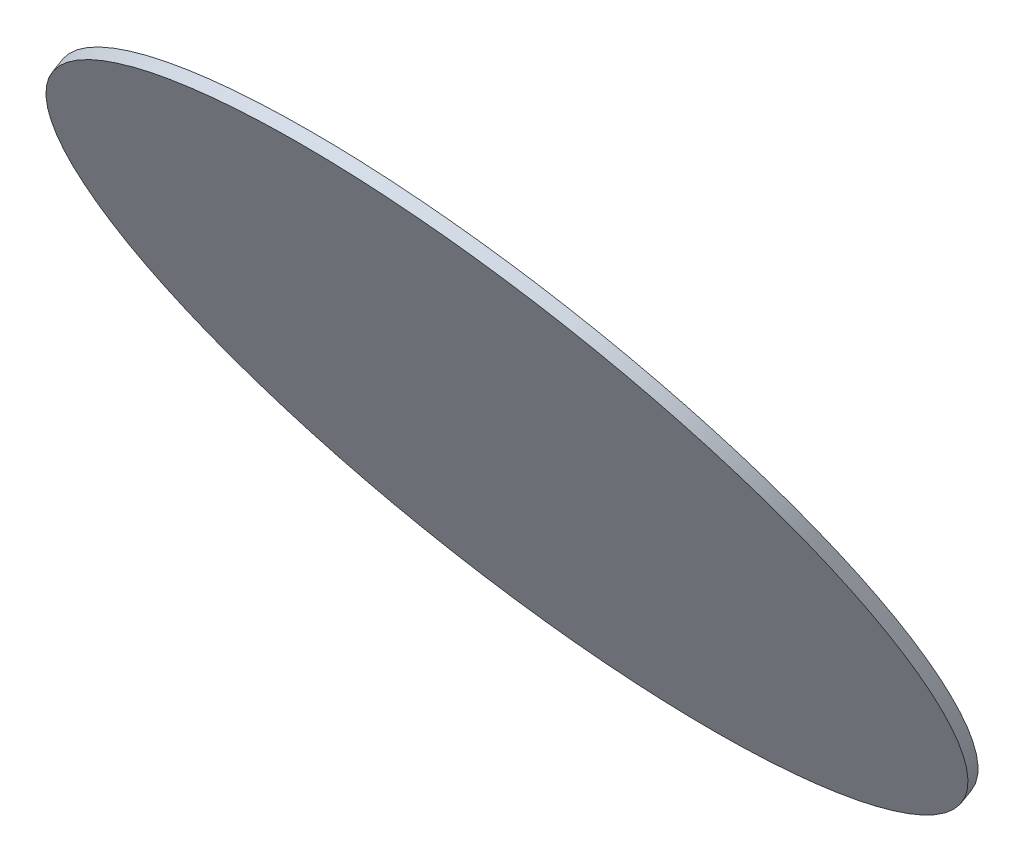
ISO-10303-21;
HEADER;
FILE_DESCRIPTION(('STEP AP214'),'2;1');
FILE_NAME('part.step','',(''),(''),'','','');
FILE_SCHEMA(('AUTOMOTIVE_DESIGN { 1 0 10303 214 1 1 1 1 }'));
ENDSEC;
DATA;
#1=APPLICATION_CONTEXT('core data for automotive mechanical design processes');
#2=APPLICATION_PROTOCOL_DEFINITION('international standard','automotive_design',2000,#1);
#3=PRODUCT_CONTEXT('',#1,'mechanical');
#4=PRODUCT('Part','Part','',(#3));
#5=PRODUCT_RELATED_PRODUCT_CATEGORY('part','',(#4));
#6=PRODUCT_DEFINITION_FORMATION('','',#4);
#7=PRODUCT_DEFINITION_CONTEXT('part definition',#1,'design');
#8=PRODUCT_DEFINITION('design','',#6,#7);
#9=PRODUCT_DEFINITION_SHAPE('','',#8);
#10=(LENGTH_UNIT() NAMED_UNIT(*) SI_UNIT(.MILLI.,.METRE.));
#11=(NAMED_UNIT(*) PLANE_ANGLE_UNIT() SI_UNIT($,.RADIAN.));
#12=(NAMED_UNIT(*) SI_UNIT($,.STERADIAN.) SOLID_ANGLE_UNIT());
#13=UNCERTAINTY_MEASURE_WITH_UNIT(LENGTH_MEASURE(1.E-05),#10,'distance_accuracy_value','');
#14=(GEOMETRIC_REPRESENTATION_CONTEXT(3) GLOBAL_UNCERTAINTY_ASSIGNED_CONTEXT((#13)) GLOBAL_UNIT_ASSIGNED_CONTEXT((#10,
#11,#12)) REPRESENTATION_CONTEXT('',''));
#15=CARTESIAN_POINT('',(0.,0.,0.));
#16=DIRECTION('',(0.,0.,1.));
#17=DIRECTION('',(1.,0.,0.));
#18=AXIS2_PLACEMENT_3D('',#15,#16,#17);
#19=CARTESIAN_POINT('',(0.,13.6941541416685,-40.8560281123041));
#20=CARTESIAN_POINT('',(-0.925381735866404,13.6941541416685,-40.8560281123041));
#21=CARTESIAN_POINT('',(-2.77614520759922,13.5362913144206,-40.9471702581106));
#22=CARTESIAN_POINT('',(-5.44560471175057,12.8350084616864,-41.3520561019148));
#23=CARTESIAN_POINT('',(-7.90579268075965,11.6961869038362,-42.0095550348986));
#24=CARTESIAN_POINT('',(-10.0621654706667,10.1635909146798,-42.894399741797));
#25=CARTESIAN_POINT('',(-11.8318548844635,8.29611729859068,-43.9725861367505));
#26=CARTESIAN_POINT('',(-13.146852750431,6.16553201934396,-45.202680121255));
#27=CARTESIAN_POINT('',(-13.9566244380395,3.85371227437508,-46.5374098733307));
#28=CARTESIAN_POINT('',(-14.2300508754592,1.44949999999972,-47.9254824771303));
#29=CARTESIAN_POINT('',(-13.9566244380395,-0.954712274375638,-49.3135550809299));
#30=CARTESIAN_POINT('',(-13.1468527504311,-3.26653201934452,-50.6482848330055));
#31=CARTESIAN_POINT('',(-11.8318548844635,-5.39711729859124,-51.8783788175101));
#32=CARTESIAN_POINT('',(-10.0621654706668,-7.26459091468032,-52.9565652124636));
#33=CARTESIAN_POINT('',(-7.90579268075964,-8.79718690383673,-53.841409919362));
#34=CARTESIAN_POINT('',(-5.44560471175057,-9.93600846168693,-54.4989088523457));
#35=CARTESIAN_POINT('',(-2.77614520759922,-10.6372913144212,-54.90379469615));
#36=CARTESIAN_POINT('',(0.,-10.874085555293,-55.0405079148598));
#37=CARTESIAN_POINT('',(2.77614520759922,-10.6372913144212,-54.90379469615));
#38=CARTESIAN_POINT('',(5.44560471175057,-9.93600846168693,-54.4989088523457));
#39=CARTESIAN_POINT('',(7.90579268075964,-8.79718690383673,-53.841409919362));
#40=CARTESIAN_POINT('',(10.0621654706668,-7.26459091468033,-52.9565652124636));
#41=CARTESIAN_POINT('',(11.8318548844635,-5.39711729859124,-51.8783788175101));
#42=CARTESIAN_POINT('',(13.146852750431,-3.26653201934453,-50.6482848330056));
#43=CARTESIAN_POINT('',(13.9566244380395,-0.954712274375641,-49.3135550809299));
#44=CARTESIAN_POINT('',(14.2300508754592,1.44949999999971,-47.9254824771303));
#45=CARTESIAN_POINT('',(13.9566244380395,3.85371227437508,-46.5374098733307));
#46=CARTESIAN_POINT('',(13.146852750431,6.16553201934395,-45.202680121255));
#47=CARTESIAN_POINT('',(11.8318548844635,8.29611729859067,-43.9725861367505));
#48=CARTESIAN_POINT('',(10.0621654706668,10.1635909146798,-42.894399741797));
#49=CARTESIAN_POINT('',(7.90579268075965,11.6961869038362,-42.0095550348986));
#50=CARTESIAN_POINT('',(5.44560471175058,12.8350084616864,-41.3520561019148));
#51=CARTESIAN_POINT('',(2.77614520759922,13.5362913144207,-40.9471702581106));
#52=CARTESIAN_POINT('',(0.92538173586641,13.6941541416685,-40.8560281123041));
#53=CARTESIAN_POINT('',(0.,13.6941541416685,-40.8560281123041));
#54=B_SPLINE_CURVE_WITH_KNOTS('',3,(#19,#20,#21,#22,#23,#24,#25,#26,#27,#28,#29,#30,#31,#32,#33,
#34,#35,#36,#37,#38,#39,#40,#41,#42,#43,#44,#45,#46,#47,#48,#49,#50,#51,#52,#53),.UNSPECIFIED.,
.T.,.F.,(4,1,1,1,1,1,1,1,1,1,1,1,1,1,1,1,1,1,1,1,1,1,1,1,1,1,1,1,1,1,1,1,4),(0.,0.03125,0.0625,
0.09375,0.125,0.15625,0.1875,0.21875,0.25,0.28125,0.3125,0.34375,0.375,0.40625,0.4375,0.46875,
0.5,0.53125,0.5625,0.59375,0.625,0.65625,0.6875,0.71875,0.75,0.78125,0.8125,0.84375,0.875,
0.90625,0.9375,0.96875,1.),.UNSPECIFIED.);
#55=DIRECTION('',(0.,0.499999999999995,-0.866025403784442));
#56=VECTOR('',#55,1.);
#57=SURFACE_OF_LINEAR_EXTRUSION('',#54,#56);
#58=CARTESIAN_POINT('',(0.,13.6941541416685,-40.8560281123041));
#59=CARTESIAN_POINT('',(0.231346854511267,13.6941541001111,-40.8560281362972));
#60=CARTESIAN_POINT('',(0.462692025309559,13.6892208694022,-40.858876338375));
#61=CARTESIAN_POINT('',(0.924826718682874,13.6695354525247,-40.8702417191083));
#62=CARTESIAN_POINT('',(1.15561623692772,13.6547831900839,-40.8787589417997));
#63=CARTESIAN_POINT('',(1.61608373302783,13.6155071340622,-40.9014349833165));
#64=CARTESIAN_POINT('',(1.84576171088309,13.5909833404813,-40.915593802142));
#65=CARTESIAN_POINT('',(2.30345164583322,13.5322113193433,-40.9495258443668));
#66=CARTESIAN_POINT('',(2.5314636158556,13.4979631673254,-40.9692990241536));
#67=CARTESIAN_POINT('',(2.98526489819354,13.4197899242284,-41.0144323670991));
#68=CARTESIAN_POINT('',(3.21105421050909,13.3758648331492,-41.0397925302578));
#69=CARTESIAN_POINT('',(3.65987506699374,13.2784784326175,-41.0960185948203));
#70=CARTESIAN_POINT('',(3.88290658972718,13.2250170490912,-41.1268845389904));
#71=CARTESIAN_POINT('',(4.32567844468135,13.108698255475,-41.1940412257965));
#72=CARTESIAN_POINT('',(4.54541877690209,13.045840845385,-41.2303319684325));
#73=CARTESIAN_POINT('',(4.98107473813176,12.9108699366452,-41.3082574589262));
#74=CARTESIAN_POINT('',(5.19699039683706,12.8387565098989,-41.3498921652704));
#75=CARTESIAN_POINT('',(5.62446184828332,12.6854141784352,-41.4384244016191));
#76=CARTESIAN_POINT('',(5.83601764102427,12.6041852737177,-41.4853219316237));
#77=CARTESIAN_POINT('',(6.25427621111408,12.4328404163353,-41.5842479311577));
#78=CARTESIAN_POINT('',(6.46097895075249,12.3427243946416,-41.6362764405409));
#79=CARTESIAN_POINT('',(6.86903982866421,12.15383292353,-41.7453329822348));
#80=CARTESIAN_POINT('',(7.07039796693751,12.055057474112,-41.8023610145456));
#81=CARTESIAN_POINT('',(7.46727790315038,11.8490745356836,-41.9212853194957));
#82=CARTESIAN_POINT('',(7.66279974641348,11.7418671121777,-41.983181554316));
#83=CARTESIAN_POINT('',(8.04751388873849,11.5192485517259,-42.1117104401194));
#84=CARTESIAN_POINT('',(8.23670618780041,11.4038374147801,-42.1783430911026));
#85=CARTESIAN_POINT('',(8.60832902655066,11.1651187874385,-42.3161673548588));
#86=CARTESIAN_POINT('',(8.79075951370299,11.0418112357118,-42.3873590030413));
#87=CARTESIAN_POINT('',(9.14842786458957,10.7876060803775,-42.534124417903));
#88=CARTESIAN_POINT('',(9.32366572832382,10.65670847677,-42.6096981845821));
#89=CARTESIAN_POINT('',(9.6665177659532,10.3876293174683,-42.7650511096382));
#90=CARTESIAN_POINT('',(9.83413199905726,10.2494478183625,-42.8448302353439));
#91=CARTESIAN_POINT('',(10.1613044835728,9.96610813535278,-43.0084164776017));
#92=CARTESIAN_POINT('',(10.3208627349843,9.82094995144882,-43.0922235941537));
#93=CARTESIAN_POINT('',(10.6315685850966,9.52403137712251,-43.2636496129684));
#94=CARTESIAN_POINT('',(10.7827161184548,9.37227093542373,-43.3512685448356));
#95=CARTESIAN_POINT('',(11.076246948178,9.06252105742628,-43.5301027202788));
#96=CARTESIAN_POINT('',(11.2186302445431,8.90453162112761,-43.621317963855));
#97=CARTESIAN_POINT('',(11.4942787720556,8.58269680214334,-43.8071293832301));
#98=CARTESIAN_POINT('',(11.6275440740219,8.41885146495526,-43.9017255327611));
#99=CARTESIAN_POINT('',(11.8846018456287,8.08567924450688,-44.0940826039235));
#100=CARTESIAN_POINT('',(12.0083943152692,7.9163523612466,-44.1918435255549));
#101=CARTESIAN_POINT('',(12.2462429251696,7.57264425423304,-44.3902834936618));
#102=CARTESIAN_POINT('',(12.3602989897912,7.39826299122845,-44.4909625627991));
#103=CARTESIAN_POINT('',(12.5784120731789,7.04487190466953,-44.6949930017531));
#104=CARTESIAN_POINT('',(12.6824690919449,6.86586208111521,-44.7983443715698));
#105=CARTESIAN_POINT('',(12.8803210910136,6.50363953405489,-45.0074736566216));
#106=CARTESIAN_POINT('',(12.9741161510237,6.32042684320709,-45.1132515530016));
#107=CARTESIAN_POINT('',(13.1511806237187,5.95022570690677,-45.3269872786989));
#108=CARTESIAN_POINT('',(13.2344500364035,5.76323726145424,-45.4349451080162));
#109=CARTESIAN_POINT('',(13.3903010174004,5.38594813155225,-45.6527730887275));
#110=CARTESIAN_POINT('',(13.4628825026855,5.19564742138497,-45.7626432549695));
#111=CARTESIAN_POINT('',(13.5971958762622,4.81219574753704,-45.9840291820868));
#112=CARTESIAN_POINT('',(13.6589277645539,4.61904478385639,-46.0955449429621));
#113=CARTESIAN_POINT('',(13.7713798938113,4.2303545180668,-46.3199553725471));
#114=CARTESIAN_POINT('',(13.8221002203099,4.03481523452172,-46.432850030539));
#115=CARTESIAN_POINT('',(13.9123669057062,3.64181180442628,-46.659750666697));
#116=CARTESIAN_POINT('',(13.9519132646039,3.44434765787592,-46.7737566448632));
#117=CARTESIAN_POINT('',(14.0197773508999,3.04797651476144,-47.0026016310393));
#118=CARTESIAN_POINT('',(14.048094991073,2.84906950700134,-47.1174406455133));
#119=CARTESIAN_POINT('',(14.0934470672161,2.45029307864819,-47.3476743237695));
#120=CARTESIAN_POINT('',(14.110481503186,2.25042365805514,-47.4630689875517));
#121=CARTESIAN_POINT('',(14.1332122903687,1.85020282247057,-47.6941365947117));
#122=CARTESIAN_POINT('',(14.1389087296526,1.64985141123514,-47.809809535921));
#123=CARTESIAN_POINT('',(14.1389087296526,1.24914858876429,-48.0411554183396));
#124=CARTESIAN_POINT('',(14.1332122903687,1.04879717752886,-48.1568283595489));
#125=CARTESIAN_POINT('',(14.110481503186,0.648576341944287,-48.3878959667089));
#126=CARTESIAN_POINT('',(14.0934470672161,0.448706921351246,-48.5032906304911));
#127=CARTESIAN_POINT('',(14.048094991073,0.0499304929981018,-48.7335243087472));
#128=CARTESIAN_POINT('',(14.0197773508999,-0.148976514762002,-48.8483633232212));
#129=CARTESIAN_POINT('',(13.9519132646039,-0.54534765787648,-49.0772083093974));
#130=CARTESIAN_POINT('',(13.9123669057062,-0.742811804426838,-49.1912142875635));
#131=CARTESIAN_POINT('',(13.8221002203099,-1.13581523452228,-49.4181149237216));
#132=CARTESIAN_POINT('',(13.7713798938113,-1.33135451806736,-49.5310095817135));
#133=CARTESIAN_POINT('',(13.6589277645539,-1.72004478385695,-49.7554200112985));
#134=CARTESIAN_POINT('',(13.5971958762622,-1.9131957475376,-49.8669357721737));
#135=CARTESIAN_POINT('',(13.4628825026855,-2.29664742138553,-50.0883216992911));
#136=CARTESIAN_POINT('',(13.3903010174004,-2.48694813155281,-50.1981918655331));
#137=CARTESIAN_POINT('',(13.2344500364035,-2.8642372614548,-50.4160198462443));
#138=CARTESIAN_POINT('',(13.1511806237187,-3.05122570690733,-50.5239776755617));
#139=CARTESIAN_POINT('',(12.9741161510237,-3.42142684320765,-50.737713401259));
#140=CARTESIAN_POINT('',(12.8803210910136,-3.60463953405544,-50.8434912976389));
#141=CARTESIAN_POINT('',(12.6824690919449,-3.96686208111576,-51.0526205826908));
#142=CARTESIAN_POINT('',(12.5784120731789,-4.14587190467009,-51.1559719525074));
#143=CARTESIAN_POINT('',(12.3602989897912,-4.499262991229,-51.3600023914614));
#144=CARTESIAN_POINT('',(12.2462429251696,-4.6736442542336,-51.4606814605988));
#145=CARTESIAN_POINT('',(12.0083943152692,-5.01735236124715,-51.6591214287057));
#146=CARTESIAN_POINT('',(11.8846018456287,-5.18667924450744,-51.756882350337));
#147=CARTESIAN_POINT('',(11.6275440740219,-5.51985146495581,-51.9492394214994));
#148=CARTESIAN_POINT('',(11.4942787720556,-5.6836968021439,-52.0438355710304));
#149=CARTESIAN_POINT('',(11.2186302445431,-6.00553162112817,-52.2296469904056));
#150=CARTESIAN_POINT('',(11.076246948178,-6.16352105742684,-52.3208622339817));
#151=CARTESIAN_POINT('',(10.7827161184548,-6.47327093542429,-52.499696409425));
#152=CARTESIAN_POINT('',(10.6315685850966,-6.62503137712307,-52.5873153412921));
#153=CARTESIAN_POINT('',(10.3208627349843,-6.92194995144938,-52.7587413601068));
#154=CARTESIAN_POINT('',(10.1613044835728,-7.06710813535334,-52.8425484766589));
#155=CARTESIAN_POINT('',(9.83413199905727,-7.35044781836307,-53.0061347189166));
#156=CARTESIAN_POINT('',(9.66651776595321,-7.48862931746883,-53.0859138446224));
#157=CARTESIAN_POINT('',(9.32366572832382,-7.75770847677053,-53.2412667696785));
#158=CARTESIAN_POINT('',(9.14842786458956,-7.88860608037808,-53.3168405363576));
#159=CARTESIAN_POINT('',(8.790759513703,-8.14281123571235,-53.4636059512193));
#160=CARTESIAN_POINT('',(8.6083290265507,-8.26611878743907,-53.5347975994018));
#161=CARTESIAN_POINT('',(8.23670618780038,-8.50483741478063,-53.672621863158));
#162=CARTESIAN_POINT('',(8.04751388873836,-8.62024855172649,-53.7392545141412));
#163=CARTESIAN_POINT('',(7.66279974641362,-8.84286711217823,-53.8677833999446));
#164=CARTESIAN_POINT('',(7.46727790315088,-8.95007453568412,-53.9296796347648));
#165=CARTESIAN_POINT('',(7.07039796693702,-9.15605747411261,-54.048603939715));
#166=CARTESIAN_POINT('',(6.86903982866236,-9.25483292353062,-54.1056319720258));
#167=CARTESIAN_POINT('',(6.46097895075435,-9.44372439464211,-54.2146885137197));
#168=CARTESIAN_POINT('',(6.254276211121,-9.53384041633559,-54.2667170231027));
#169=CARTESIAN_POINT('',(5.83601764101735,-9.70518527371861,-54.365643022637));
#170=CARTESIAN_POINT('',(5.62446184825749,-9.78641417843685,-54.4125405526421));
#171=CARTESIAN_POINT('',(5.1969903968629,-9.93975650989838,-54.5010727889896));
#172=CARTESIAN_POINT('',(4.98107473822817,-10.0118699366417,-54.542707495332));
#173=CARTESIAN_POINT('',(4.5454187768057,-10.1468408453897,-54.6206329858304));
#174=CARTESIAN_POINT('',(4.32567844432159,-10.209698255491,-54.656923728473));
#175=CARTESIAN_POINT('',(3.88290659008696,-10.3260170490764,-54.7240804152613));
#176=CARTESIAN_POINT('',(3.65987506833644,-10.3794784325606,-54.7549463594072));
#177=CARTESIAN_POINT('',(3.21105420916643,-10.4768648332072,-54.8111724240359));
#178=CARTESIAN_POINT('',(2.98526489318263,-10.5207899244432,-54.8365325872852));
#179=CARTESIAN_POINT('',(2.53146362086654,-10.5989631671118,-54.8816659299833));
#180=CARTESIAN_POINT('',(2.30345166453424,-10.6332113185444,-54.9014391094322));
#181=CARTESIAN_POINT('',(1.84576169218195,-10.6919833412814,-54.9353711525802));
#182=CARTESIAN_POINT('',(1.61608366323395,-10.7165071370465,-54.9495299726667));
#183=CARTESIAN_POINT('',(1.15561630672162,-10.7557831871008,-54.9722060107383));
#184=CARTESIAN_POINT('',(0.924826979157289,-10.7705354413899,-54.9807232287232));
#185=CARTESIAN_POINT('',(0.462691764837186,-10.790220880538,-54.9920886223145));
#186=CARTESIAN_POINT('',(0.231345882418597,-10.795154141669,-54.9949368419565));
#187=CARTESIAN_POINT('',(-0.231345882418579,-10.795154141669,-54.9949368419565));
#188=CARTESIAN_POINT('',(-0.462691764837167,-10.790220880538,-54.9920886223145));
#189=CARTESIAN_POINT('',(-0.92482697915727,-10.7705354413899,-54.9807232287232));
#190=CARTESIAN_POINT('',(-1.1556163067216,-10.7557831871008,-54.9722060107383));
#191=CARTESIAN_POINT('',(-1.61608366323393,-10.7165071370465,-54.9495299726667));
#192=CARTESIAN_POINT('',(-1.84576169218193,-10.6919833412814,-54.9353711525802));
#193=CARTESIAN_POINT('',(-2.30345166453422,-10.6332113185444,-54.9014391094322));
#194=CARTESIAN_POINT('',(-2.53146362086651,-10.5989631671118,-54.8816659299833));
#195=CARTESIAN_POINT('',(-2.98526489318261,-10.5207899244432,-54.8365325872851));
#196=CARTESIAN_POINT('',(-3.21105420916641,-10.4768648332072,-54.8111724240359));
#197=CARTESIAN_POINT('',(-3.65987506833642,-10.3794784325606,-54.7549463594072));
#198=CARTESIAN_POINT('',(-3.88290659008694,-10.3260170490764,-54.7240804152613));
#199=CARTESIAN_POINT('',(-4.32567844432157,-10.209698255491,-54.656923728473));
#200=CARTESIAN_POINT('',(-4.54541877680568,-10.1468408453897,-54.6206329858304));
#201=CARTESIAN_POINT('',(-4.98107473822815,-10.0118699366417,-54.542707495332));
#202=CARTESIAN_POINT('',(-5.19699039686289,-9.93975650989838,-54.5010727889896));
#203=CARTESIAN_POINT('',(-5.62446184825748,-9.78641417843685,-54.4125405526421));
#204=CARTESIAN_POINT('',(-5.83601764101734,-9.70518527371862,-54.365643022637));
#205=CARTESIAN_POINT('',(-6.25427621112099,-9.53384041633559,-54.2667170231027));
#206=CARTESIAN_POINT('',(-6.46097895075434,-9.44372439464212,-54.2146885137197));
#207=CARTESIAN_POINT('',(-6.86903982866235,-9.25483292353062,-54.1056319720258));
#208=CARTESIAN_POINT('',(-7.07039796693701,-9.15605747411261,-54.048603939715));
#209=CARTESIAN_POINT('',(-7.46727790315087,-8.95007453568412,-53.9296796347648));
#210=CARTESIAN_POINT('',(-7.6627997464136,-8.84286711217823,-53.8677833999446));
#211=CARTESIAN_POINT('',(-8.04751388873835,-8.62024855172649,-53.7392545141412));
#212=CARTESIAN_POINT('',(-8.23670618780036,-8.50483741478063,-53.672621863158));
#213=CARTESIAN_POINT('',(-8.60832902655069,-8.26611878743908,-53.5347975994018));
#214=CARTESIAN_POINT('',(-8.79075951370299,-8.14281123571235,-53.4636059512192));
#215=CARTESIAN_POINT('',(-9.14842786458955,-7.88860608037808,-53.3168405363576));
#216=CARTESIAN_POINT('',(-9.32366572832381,-7.75770847677053,-53.2412667696785));
#217=CARTESIAN_POINT('',(-9.6665177659532,-7.48862931746884,-53.0859138446224));
#218=CARTESIAN_POINT('',(-9.83413199905726,-7.35044781836308,-53.0061347189166));
#219=CARTESIAN_POINT('',(-10.1613044835728,-7.06710813535335,-52.8425484766589));
#220=CARTESIAN_POINT('',(-10.3208627349843,-6.92194995144938,-52.7587413601068));
#221=CARTESIAN_POINT('',(-10.6315685850966,-6.62503137712308,-52.5873153412921));
#222=CARTESIAN_POINT('',(-10.7827161184548,-6.47327093542429,-52.499696409425));
#223=CARTESIAN_POINT('',(-11.076246948178,-6.16352105742684,-52.3208622339817));
#224=CARTESIAN_POINT('',(-11.2186302445431,-6.00553162112818,-52.2296469904056));
#225=CARTESIAN_POINT('',(-11.4942787720556,-5.68369680214391,-52.0438355710304));
#226=CARTESIAN_POINT('',(-11.6275440740219,-5.51985146495582,-51.9492394214994));
#227=CARTESIAN_POINT('',(-11.8846018456287,-5.18667924450745,-51.7568823503371));
#228=CARTESIAN_POINT('',(-12.0083943152692,-5.01735236124716,-51.6591214287057));
#229=CARTESIAN_POINT('',(-12.2462429251696,-4.67364425423361,-51.4606814605988));
#230=CARTESIAN_POINT('',(-12.3602989897912,-4.49926299122901,-51.3600023914614));
#231=CARTESIAN_POINT('',(-12.5784120731789,-4.1458719046701,-51.1559719525074));
#232=CARTESIAN_POINT('',(-12.6824690919449,-3.96686208111577,-51.0526205826907));
#233=CARTESIAN_POINT('',(-12.8803210910136,-3.60463953405545,-50.8434912976389));
#234=CARTESIAN_POINT('',(-12.9741161510237,-3.42142684320766,-50.737713401259));
#235=CARTESIAN_POINT('',(-13.1511806237187,-3.05122570690733,-50.5239776755617));
#236=CARTESIAN_POINT('',(-13.2344500364035,-2.86423726145481,-50.4160198462443));
#237=CARTESIAN_POINT('',(-13.3903010174004,-2.48694813155282,-50.1981918655331));
#238=CARTESIAN_POINT('',(-13.4628825026855,-2.29664742138553,-50.0883216992911));
#239=CARTESIAN_POINT('',(-13.5971958762622,-1.9131957475376,-49.8669357721737));
#240=CARTESIAN_POINT('',(-13.6589277645539,-1.72004478385695,-49.7554200112985));
#241=CARTESIAN_POINT('',(-13.7713798938113,-1.33135451806736,-49.5310095817135));
#242=CARTESIAN_POINT('',(-13.8221002203099,-1.13581523452228,-49.4181149237216));
#243=CARTESIAN_POINT('',(-13.9123669057062,-0.74281180442684,-49.1912142875635));
#244=CARTESIAN_POINT('',(-13.9519132646039,-0.545347657876483,-49.0772083093974));
#245=CARTESIAN_POINT('',(-14.0197773508999,-0.148976514762003,-48.8483633232213));
#246=CARTESIAN_POINT('',(-14.048094991073,0.049930492998103,-48.7335243087473));
#247=CARTESIAN_POINT('',(-14.0934470672161,0.448706921351249,-48.5032906304911));
#248=CARTESIAN_POINT('',(-14.110481503186,0.648576341944288,-48.3878959667089));
#249=CARTESIAN_POINT('',(-14.1332122903687,1.04879717752887,-48.1568283595489));
#250=CARTESIAN_POINT('',(-14.1389087296526,1.24914858876429,-48.0411554183396));
#251=CARTESIAN_POINT('',(-14.1389087296526,1.64985141123515,-47.809809535921));
#252=CARTESIAN_POINT('',(-14.1332122903687,1.85020282247057,-47.6941365947117));
#253=CARTESIAN_POINT('',(-14.110481503186,2.25042365805515,-47.4630689875517));
#254=CARTESIAN_POINT('',(-14.0934470672161,2.45029307864819,-47.3476743237695));
#255=CARTESIAN_POINT('',(-14.048094991073,2.84906950700133,-47.1174406455133));
#256=CARTESIAN_POINT('',(-14.0197773508999,3.04797651476144,-47.0026016310393));
#257=CARTESIAN_POINT('',(-13.9519132646039,3.44434765787592,-46.7737566448632));
#258=CARTESIAN_POINT('',(-13.9123669057062,3.64181180442628,-46.659750666697));
#259=CARTESIAN_POINT('',(-13.8221002203099,4.03481523452171,-46.432850030539));
#260=CARTESIAN_POINT('',(-13.7713798938113,4.2303545180668,-46.3199553725471));
#261=CARTESIAN_POINT('',(-13.6589277645539,4.61904478385639,-46.0955449429621));
#262=CARTESIAN_POINT('',(-13.5971958762622,4.81219574753704,-45.9840291820868));
#263=CARTESIAN_POINT('',(-13.4628825026855,5.19564742138497,-45.7626432549695));
#264=CARTESIAN_POINT('',(-13.3903010174004,5.38594813155225,-45.6527730887275));
#265=CARTESIAN_POINT('',(-13.2344500364035,5.76323726145424,-45.4349451080162));
#266=CARTESIAN_POINT('',(-13.1511806237187,5.95022570690677,-45.3269872786989));
#267=CARTESIAN_POINT('',(-12.9741161510237,6.32042684320709,-45.1132515530016));
#268=CARTESIAN_POINT('',(-12.8803210910136,6.50363953405489,-45.0074736566216));
#269=CARTESIAN_POINT('',(-12.6824690919449,6.86586208111521,-44.7983443715698));
#270=CARTESIAN_POINT('',(-12.5784120731789,7.04487190466953,-44.6949930017531));
#271=CARTESIAN_POINT('',(-12.3602989897912,7.39826299122845,-44.4909625627991));
#272=CARTESIAN_POINT('',(-12.2462429251696,7.57264425423304,-44.3902834936618));
#273=CARTESIAN_POINT('',(-12.0083943152692,7.9163523612466,-44.1918435255549));
#274=CARTESIAN_POINT('',(-11.8846018456287,8.08567924450688,-44.0940826039235));
#275=CARTESIAN_POINT('',(-11.6275440740219,8.41885146495526,-43.9017255327612));
#276=CARTESIAN_POINT('',(-11.4942787720556,8.58269680214335,-43.8071293832302));
#277=CARTESIAN_POINT('',(-11.2186302445431,8.90453162112761,-43.621317963855));
#278=CARTESIAN_POINT('',(-11.076246948178,9.06252105742628,-43.5301027202788));
#279=CARTESIAN_POINT('',(-10.7827161184548,9.37227093542372,-43.3512685448356));
#280=CARTESIAN_POINT('',(-10.6315685850966,9.52403137712251,-43.2636496129684));
#281=CARTESIAN_POINT('',(-10.3208627349843,9.82094995144882,-43.0922235941537));
#282=CARTESIAN_POINT('',(-10.1613044835728,9.96610813535278,-43.0084164776017));
#283=CARTESIAN_POINT('',(-9.83413199905726,10.2494478183625,-42.8448302353439));
#284=CARTESIAN_POINT('',(-9.66651776595319,10.3876293174683,-42.7650511096382));
#285=CARTESIAN_POINT('',(-9.32366572832382,10.65670847677,-42.6096981845821));
#286=CARTESIAN_POINT('',(-9.14842786458956,10.7876060803775,-42.534124417903));
#287=CARTESIAN_POINT('',(-8.79075951370298,11.0418112357118,-42.3873590030413));
#288=CARTESIAN_POINT('',(-8.60832902655065,11.1651187874385,-42.3161673548588));
#289=CARTESIAN_POINT('',(-8.23670618780041,11.4038374147801,-42.1783430911026));
#290=CARTESIAN_POINT('',(-8.04751388873849,11.5192485517259,-42.1117104401194));
#291=CARTESIAN_POINT('',(-7.66279974641348,11.7418671121777,-41.983181554316));
#292=CARTESIAN_POINT('',(-7.46727790315038,11.8490745356836,-41.9212853194957));
#293=CARTESIAN_POINT('',(-7.07039796693751,12.055057474112,-41.8023610145456));
#294=CARTESIAN_POINT('',(-6.86903982866421,12.15383292353,-41.7453329822348));
#295=CARTESIAN_POINT('',(-6.46097895075249,12.3427243946416,-41.6362764405409));
#296=CARTESIAN_POINT('',(-6.25427621111408,12.4328404163353,-41.5842479311577));
#297=CARTESIAN_POINT('',(-5.83601764102427,12.6041852737178,-41.4853219316237));
#298=CARTESIAN_POINT('',(-5.62446184828332,12.6854141784352,-41.4384244016191));
#299=CARTESIAN_POINT('',(-5.19699039683706,12.8387565098989,-41.3498921652704));
#300=CARTESIAN_POINT('',(-4.98107473813176,12.9108699366452,-41.3082574589262));
#301=CARTESIAN_POINT('',(-4.54541877690209,13.045840845385,-41.2303319684325));
#302=CARTESIAN_POINT('',(-4.32567844468135,13.108698255475,-41.1940412257965));
#303=CARTESIAN_POINT('',(-3.88290658972718,13.2250170490912,-41.1268845389904));
#304=CARTESIAN_POINT('',(-3.65987506699374,13.2784784326174,-41.0960185948203));
#305=CARTESIAN_POINT('',(-3.21105421050909,13.3758648331492,-41.0397925302578));
#306=CARTESIAN_POINT('',(-2.98526489819354,13.4197899242284,-41.0144323670991));
#307=CARTESIAN_POINT('',(-2.5314636158556,13.4979631673254,-40.9692990241536));
#308=CARTESIAN_POINT('',(-2.30345164583322,13.5322113193433,-40.9495258443668));
#309=CARTESIAN_POINT('',(-1.84576171088309,13.5909833404813,-40.915593802142));
#310=CARTESIAN_POINT('',(-1.61608373302783,13.6155071340622,-40.9014349833165));
#311=CARTESIAN_POINT('',(-1.15561623692772,13.6547831900839,-40.8787589417997));
#312=CARTESIAN_POINT('',(-0.924826718682872,13.6695354525247,-40.8702417191083));
#313=CARTESIAN_POINT('',(-0.462692025309557,13.6892208694022,-40.858876338375));
#314=CARTESIAN_POINT('',(-0.231346854511264,13.6941541001111,-40.8560281362972));
#315=CARTESIAN_POINT('',(0.,13.6941541416685,-40.8560281123041));
#316=B_SPLINE_CURVE_WITH_KNOTS('',3,(#58,#59,#60,#61,#62,#63,#64,#65,#66,#67,#68,#69,#70,#71,
#72,#73,#74,#75,#76,#77,#78,#79,#80,#81,#82,#83,#84,#85,#86,#87,#88,#89,#90,#91,#92,#93,#94,#95,
#96,#97,#98,#99,#100,#101,#102,#103,#104,#105,#106,#107,#108,#109,#110,#111,#112,#113,#114,#115,
#116,#117,#118,#119,#120,#121,#122,#123,#124,#125,#126,#127,#128,#129,#130,#131,#132,#133,#134,
#135,#136,#137,#138,#139,#140,#141,#142,#143,#144,#145,#146,#147,#148,#149,#150,#151,#152,#153,
#154,#155,#156,#157,#158,#159,#160,#161,#162,#163,#164,#165,#166,#167,#168,#169,#170,#171,#172,
#173,#174,#175,#176,#177,#178,#179,#180,#181,#182,#183,#184,#185,#186,#187,#188,#189,#190,#191,
#192,#193,#194,#195,#196,#197,#198,#199,#200,#201,#202,#203,#204,#205,#206,#207,#208,#209,#210,
#211,#212,#213,#214,#215,#216,#217,#218,#219,#220,#221,#222,#223,#224,#225,#226,#227,#228,#229,
#230,#231,#232,#233,#234,#235,#236,#237,#238,#239,#240,#241,#242,#243,#244,#245,#246,#247,#248,
#249,#250,#251,#252,#253,#254,#255,#256,#257,#258,#259,#260,#261,#262,#263,#264,#265,#266,#267,
#268,#269,#270,#271,#272,#273,#274,#275,#276,#277,#278,#279,#280,#281,#282,#283,#284,#285,#286,
#287,#288,#289,#290,#291,#292,#293,#294,#295,#296,#297,#298,#299,#300,#301,#302,#303,#304,#305,
#306,#307,#308,#309,#310,#311,#312,#313,#314,#315),.UNSPECIFIED.,.F.,.F.,(4,2,2,2,2,2,2,2,2,2,2,
2,2,2,2,2,2,2,2,2,2,2,2,2,2,2,2,2,2,2,2,2,2,2,2,2,2,2,2,2,2,2,2,2,2,2,2,2,2,2,2,2,2,2,2,2,2,2,2,
2,2,2,2,2,2,2,2,2,2,2,2,2,2,2,2,2,2,2,2,2,2,2,2,2,2,2,2,2,2,2,2,2,2,2,2,2,2,2,2,2,2,2,2,2,2,2,2,
2,2,2,2,2,2,2,2,2,2,2,2,2,2,2,2,2,2,2,2,2,4),(0.,0.693968245412317,1.38794188149219,
2.08191551757205,2.77588376298437,3.46985200839669,4.16382564447656,4.85779928055643,
5.55176752596875,6.24573577138107,6.93970940746094,7.63368304354081,8.32765128895313,
9.02161953436545,9.71559317044531,10.4095668065252,11.1035350519375,11.7975032973498,
12.4914769334297,13.1854505695096,13.8794188149219,14.5733870603342,15.2673606964141,
15.9613343324939,16.6553025779062,17.3492708233186,18.0432444593984,18.7372180954783,
19.4311863408906,20.125154586303,20.8191282223828,21.5131018584627,22.207070103875,
22.9010383492873,23.5950119853672,24.2889856214471,24.9829538668594,25.6769221122717,
26.3708957483516,27.0648693844314,27.7588376298438,28.4528058752561,29.1467795113359,
29.8407531474158,30.5347213928281,31.2286896382404,31.9226632743203,32.6166369104002,
33.3106051558125,34.0045734012248,34.6985470373047,35.3925206733846,36.0864889187969,
36.7804571642092,37.4744308002891,38.1684044363689,38.8623726817813,39.5563409271936,
40.2503145632734,40.9442881993533,41.6382564447656,42.332224690178,43.0261983262578,
43.7201719623377,44.41414020775,45.1081084531623,45.8020820892422,46.4960557253221,
47.1900239707344,47.8839922161467,48.5779658522266,49.2719394883065,49.9659077337188,
50.6598759791311,51.353849615211,52.0478232512908,52.7417914967031,53.4357597421155,
54.1297333781953,54.8237070142752,55.5176752596875,56.2116435050998,56.9056171411797,
57.5995907772596,58.2935590226719,58.9875272680842,59.6815009041641,60.375474540244,
61.0694427856563,61.7634110310686,62.4573846671485,63.1513583032283,63.8453265486407,
64.539294794053,65.2332684301328,65.9272420662127,66.621210311625,67.3151785570373,
68.0091521931172,68.7031258291971,69.3970940746094,70.0910623200217,70.7850359561016,
71.4790095921815,72.1729778375938,72.8669460830061,73.560919719086,74.2548933551658,
74.9488616005782,75.6428298459905,76.3368034820703,77.0307771181502,77.7247453635625,
78.4187136089748,79.1126872450547,79.8066608811346,80.5006291265469,81.1945973719592,
81.8885710080391,82.582544644119,83.2765128895313,83.9704811349436,84.6644547710235,
85.3584284071033,86.0523966525157,86.746364897928,87.4403385340079,88.1343121700877,
88.8282804155),.UNSPECIFIED.);
#317=CARTESIAN_POINT('',(0.,13.6941541416685,-40.8560281123041));
#318=VERTEX_POINT('',#317);
#319=EDGE_CURVE('E10',#318,#318,#316,.F.);
#320=ORIENTED_EDGE('',*,*,#319,.F.);
#321=EDGE_LOOP('',(#320));
#322=FACE_BOUND('',#321,.T.);
#323=CARTESIAN_POINT('',(0.,13.8941541416685,-41.2024382738178));
#324=CARTESIAN_POINT('',(-0.925381735866404,13.8941541416685,-41.2024382738178));
#325=CARTESIAN_POINT('',(-2.77614520759922,13.7362913144206,-41.2935804196244));
#326=CARTESIAN_POINT('',(-5.44560471175057,13.0350084616864,-41.6984662634286));
#327=CARTESIAN_POINT('',(-7.90579268075965,11.8961869038362,-42.3559651964124));
#328=CARTESIAN_POINT('',(-10.0621654706667,10.3635909146798,-43.2408099033107));
#329=CARTESIAN_POINT('',(-11.8318548844635,8.49611729859068,-44.3189962982643));
#330=CARTESIAN_POINT('',(-13.146852750431,6.36553201934396,-45.5490902827688));
#331=CARTESIAN_POINT('',(-13.9566244380395,4.05371227437508,-46.8838200348445));
#332=CARTESIAN_POINT('',(-14.2300508754592,1.64949999999972,-48.2718926386441));
#333=CARTESIAN_POINT('',(-13.9566244380395,-0.754712274375638,-49.6599652424437));
#334=CARTESIAN_POINT('',(-13.1468527504311,-3.06653201934452,-50.9946949945193));
#335=CARTESIAN_POINT('',(-11.8318548844635,-5.19711729859124,-52.2247889790238));
#336=CARTESIAN_POINT('',(-10.0621654706668,-7.06459091468032,-53.3029753739774));
#337=CARTESIAN_POINT('',(-7.90579268075964,-8.59718690383673,-54.1878200808758));
#338=CARTESIAN_POINT('',(-5.44560471175057,-9.73600846168693,-54.8453190138595));
#339=CARTESIAN_POINT('',(-2.77614520759922,-10.4372913144212,-55.2502048576637));
#340=CARTESIAN_POINT('',(0.,-10.674085555293,-55.3869180763736));
#341=CARTESIAN_POINT('',(2.77614520759922,-10.4372913144212,-55.2502048576637));
#342=CARTESIAN_POINT('',(5.44560471175057,-9.73600846168693,-54.8453190138595));
#343=CARTESIAN_POINT('',(7.90579268075964,-8.59718690383673,-54.1878200808758));
#344=CARTESIAN_POINT('',(10.0621654706668,-7.06459091468033,-53.3029753739774));
#345=CARTESIAN_POINT('',(11.8318548844635,-5.19711729859124,-52.2247889790238));
#346=CARTESIAN_POINT('',(13.146852750431,-3.06653201934453,-50.9946949945193));
#347=CARTESIAN_POINT('',(13.9566244380395,-0.754712274375642,-49.6599652424436));
#348=CARTESIAN_POINT('',(14.2300508754592,1.64949999999971,-48.2718926386441));
#349=CARTESIAN_POINT('',(13.9566244380395,4.05371227437508,-46.8838200348445));
#350=CARTESIAN_POINT('',(13.146852750431,6.36553201934395,-45.5490902827688));
#351=CARTESIAN_POINT('',(11.8318548844635,8.49611729859067,-44.3189962982643));
#352=CARTESIAN_POINT('',(10.0621654706668,10.3635909146798,-43.2408099033107));
#353=CARTESIAN_POINT('',(7.90579268075965,11.8961869038362,-42.3559651964124));
#354=CARTESIAN_POINT('',(5.44560471175058,13.0350084616864,-41.6984662634286));
#355=CARTESIAN_POINT('',(2.77614520759922,13.7362913144207,-41.2935804196244));
#356=CARTESIAN_POINT('',(0.92538173586641,13.8941541416685,-41.2024382738178));
#357=CARTESIAN_POINT('',(0.,13.8941541416685,-41.2024382738178));
#358=B_SPLINE_CURVE_WITH_KNOTS('',3,(#323,#324,#325,#326,#327,#328,#329,#330,#331,#332,#333,
#334,#335,#336,#337,#338,#339,#340,#341,#342,#343,#344,#345,#346,#347,#348,#349,#350,#351,#352,
#353,#354,#355,#356,#357),.UNSPECIFIED.,.T.,.F.,(4,1,1,1,1,1,1,1,1,1,1,1,1,1,1,1,1,1,1,1,1,1,1,
1,1,1,1,1,1,1,1,1,4),(0.,0.03125,0.0625,0.09375,0.125,0.15625,0.1875,0.21875,0.25,0.28125,
0.3125,0.34375,0.375,0.40625,0.4375,0.46875,0.5,0.53125,0.5625,0.59375,0.625,0.65625,0.6875,
0.71875,0.75,0.78125,0.8125,0.84375,0.875,0.90625,0.9375,0.96875,1.),.UNSPECIFIED.);
#359=CARTESIAN_POINT('',(0.,13.8941541416685,-41.2024382738178));
#360=VERTEX_POINT('',#359);
#361=EDGE_CURVE('E25',#360,#360,#358,.T.);
#362=ORIENTED_EDGE('',*,*,#361,.T.);
#363=EDGE_LOOP('',(#362));
#364=FACE_BOUND('',#363,.T.);
#365=ADVANCED_FACE('F15',(#322,#364),#57,.F.);
#366=CARTESIAN_POINT('',(0.,-10.4583493020364,-54.8004824771302));
#367=DIRECTION('',(0.,0.499999999999995,-0.866025403784442));
#368=DIRECTION('',(-1.,0.,0.));
#369=AXIS2_PLACEMENT_3D('',#366,#367,#368);
#370=PLANE('',#369);
#371=ORIENTED_EDGE('',*,*,#319,.T.);
#372=EDGE_LOOP('',(#371));
#373=FACE_BOUND('',#372,.T.);
#374=ADVANCED_FACE('F60',(#373),#370,.F.);
#375=CARTESIAN_POINT('',(0.,-10.2583493020364,-55.146892638644));
#376=DIRECTION('',(0.,0.499999999999995,-0.866025403784442));
#377=DIRECTION('',(-1.,0.,0.));
#378=AXIS2_PLACEMENT_3D('',#375,#376,#377);
#379=PLANE('',#378);
#380=ORIENTED_EDGE('',*,*,#361,.F.);
#381=EDGE_LOOP('',(#380));
#382=FACE_BOUND('',#381,.T.);
#383=ADVANCED_FACE('F68',(#382),#379,.T.);
#384=CLOSED_SHELL('',(#365,#374,#383));
#385=MANIFOLD_SOLID_BREP('B1',#384);
#386=ADVANCED_BREP_SHAPE_REPRESENTATION('',(#18,#385),#14);
#387=SHAPE_DEFINITION_REPRESENTATION(#9,#386);
ENDSEC;
END-ISO-10303-21;
